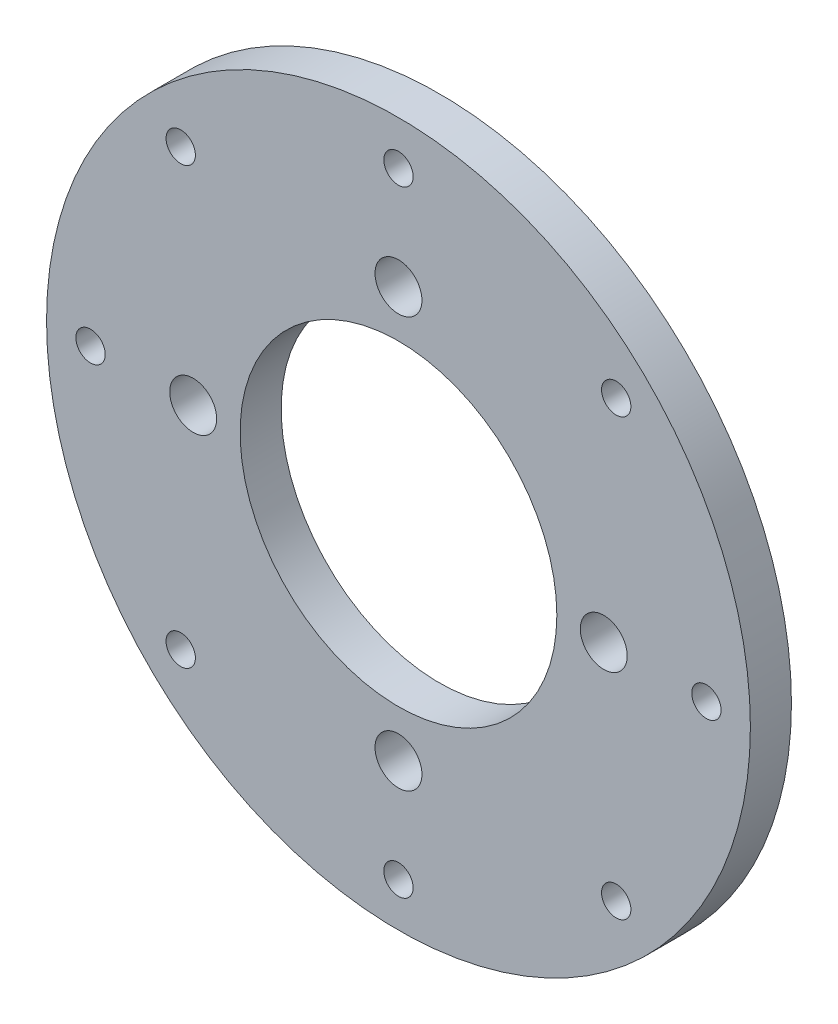
ISO-10303-21;
HEADER;
FILE_DESCRIPTION(('STEP AP214'),'2;1');
FILE_NAME('part.step','',(''),(''),'','','');
FILE_SCHEMA(('AUTOMOTIVE_DESIGN { 1 0 10303 214 1 1 1 1 }'));
ENDSEC;
DATA;
#1=APPLICATION_CONTEXT('core data for automotive mechanical design processes');
#2=APPLICATION_PROTOCOL_DEFINITION('international standard','automotive_design',2000,#1);
#3=PRODUCT_CONTEXT('',#1,'mechanical');
#4=PRODUCT('Part','Part','',(#3));
#5=PRODUCT_RELATED_PRODUCT_CATEGORY('part','',(#4));
#6=PRODUCT_DEFINITION_FORMATION('','',#4);
#7=PRODUCT_DEFINITION_CONTEXT('part definition',#1,'design');
#8=PRODUCT_DEFINITION('design','',#6,#7);
#9=PRODUCT_DEFINITION_SHAPE('','',#8);
#10=(LENGTH_UNIT() NAMED_UNIT(*) SI_UNIT(.MILLI.,.METRE.));
#11=(NAMED_UNIT(*) PLANE_ANGLE_UNIT() SI_UNIT($,.RADIAN.));
#12=(NAMED_UNIT(*) SI_UNIT($,.STERADIAN.) SOLID_ANGLE_UNIT());
#13=UNCERTAINTY_MEASURE_WITH_UNIT(LENGTH_MEASURE(1.E-05),#10,'distance_accuracy_value','');
#14=(GEOMETRIC_REPRESENTATION_CONTEXT(3) GLOBAL_UNCERTAINTY_ASSIGNED_CONTEXT((#13)) GLOBAL_UNIT_ASSIGNED_CONTEXT((#10,
#11,#12)) REPRESENTATION_CONTEXT('',''));
#15=CARTESIAN_POINT('',(0.,0.,0.));
#16=DIRECTION('',(0.,0.,1.));
#17=DIRECTION('',(1.,0.,0.));
#18=AXIS2_PLACEMENT_3D('',#15,#16,#17);
#19=CARTESIAN_POINT('',(0.,0.,7.));
#20=DIRECTION('',(0.,0.,-1.));
#21=DIRECTION('',(-1.,0.,0.));
#22=AXIS2_PLACEMENT_3D('',#19,#20,#21);
#23=CYLINDRICAL_SURFACE('',#22,60.);
#24=CARTESIAN_POINT('',(0.,0.,7.));
#25=DIRECTION('',(0.,0.,1.));
#26=DIRECTION('',(1.,0.,0.));
#27=AXIS2_PLACEMENT_3D('',#24,#25,#26);
#28=CIRCLE('',#27,60.);
#29=CARTESIAN_POINT('',(60.,0.,7.));
#30=VERTEX_POINT('',#29);
#31=EDGE_CURVE('E10',#30,#30,#28,.T.);
#32=ORIENTED_EDGE('',*,*,#31,.F.);
#33=EDGE_LOOP('',(#32));
#34=FACE_BOUND('',#33,.T.);
#35=CARTESIAN_POINT('',(0.,0.,0.));
#36=DIRECTION('',(0.,0.,1.));
#37=DIRECTION('',(1.,0.,0.));
#38=AXIS2_PLACEMENT_3D('',#35,#36,#37);
#39=CIRCLE('',#38,60.);
#40=CARTESIAN_POINT('',(60.,0.,0.));
#41=VERTEX_POINT('',#40);
#42=EDGE_CURVE('E36',#41,#41,#39,.T.);
#43=ORIENTED_EDGE('',*,*,#42,.T.);
#44=EDGE_LOOP('',(#43));
#45=FACE_BOUND('',#44,.T.);
#46=ADVANCED_FACE('F33',(#34,#45),#23,.T.);
#47=CARTESIAN_POINT('',(0.,0.,7.));
#48=DIRECTION('',(0.,0.,1.));
#49=DIRECTION('',(1.,0.,0.));
#50=AXIS2_PLACEMENT_3D('',#47,#48,#49);
#51=PLANE('',#50);
#52=CARTESIAN_POINT('',(52.5000000000015,1.48571034940069E-12,7.));
#53=DIRECTION('',(0.,0.,1.));
#54=DIRECTION('',(1.,0.,0.));
#55=AXIS2_PLACEMENT_3D('',#52,#53,#54);
#56=CIRCLE('',#55,2.50000000000117);
#57=CARTESIAN_POINT('',(55.0000000000026,1.48571034940069E-12,7.));
#58=VERTEX_POINT('',#57);
#59=EDGE_CURVE('E78',#58,#58,#56,.T.);
#60=ORIENTED_EDGE('',*,*,#59,.F.);
#61=EDGE_LOOP('',(#60));
#62=FACE_BOUND('',#61,.T.);
#63=CARTESIAN_POINT('',(37.1231060123011,-37.1231060122908,7.));
#64=DIRECTION('',(0.,0.,1.));
#65=DIRECTION('',(1.,0.,0.));
#66=AXIS2_PLACEMENT_3D('',#63,#64,#65);
#67=CIRCLE('',#66,2.50000000000633);
#68=CARTESIAN_POINT('',(39.6231060123074,-37.1231060122908,7.));
#69=VERTEX_POINT('',#68);
#70=EDGE_CURVE('E97',#69,#69,#67,.T.);
#71=ORIENTED_EDGE('',*,*,#70,.F.);
#72=EDGE_LOOP('',(#71));
#73=FACE_BOUND('',#72,.T.);
#74=CARTESIAN_POINT('',(-52.4999999999985,-1.49213974509621E-12,7.));
#75=DIRECTION('',(0.,0.,1.));
#76=DIRECTION('',(1.,0.,0.));
#77=AXIS2_PLACEMENT_3D('',#74,#75,#76);
#78=CIRCLE('',#77,2.50000000000239);
#79=CARTESIAN_POINT('',(-49.9999999999961,-1.49213974509621E-12,7.));
#80=VERTEX_POINT('',#79);
#81=EDGE_CURVE('E91',#80,#80,#78,.T.);
#82=ORIENTED_EDGE('',*,*,#81,.F.);
#83=EDGE_LOOP('',(#82));
#84=FACE_BOUND('',#83,.T.);
#85=CARTESIAN_POINT('',(-37.1231060122925,37.1231060122907,7.));
#86=DIRECTION('',(0.,0.,1.));
#87=DIRECTION('',(1.,0.,0.));
#88=AXIS2_PLACEMENT_3D('',#85,#86,#87);
#89=CIRCLE('',#88,2.50000000000272);
#90=CARTESIAN_POINT('',(-34.6231060122898,37.1231060122907,7.));
#91=VERTEX_POINT('',#90);
#92=EDGE_CURVE('E84',#91,#91,#89,.T.);
#93=ORIENTED_EDGE('',*,*,#92,.F.);
#94=EDGE_LOOP('',(#93));
#95=FACE_BOUND('',#94,.T.);
#96=CARTESIAN_POINT('',(0.,52.5,7.));
#97=DIRECTION('',(0.,0.,1.));
#98=DIRECTION('',(1.,0.,0.));
#99=AXIS2_PLACEMENT_3D('',#96,#97,#98);
#100=CIRCLE('',#99,2.5);
#101=CARTESIAN_POINT('',(2.5,52.5,7.));
#102=VERTEX_POINT('',#101);
#103=EDGE_CURVE('E85',#102,#102,#100,.T.);
#104=ORIENTED_EDGE('',*,*,#103,.F.);
#105=EDGE_LOOP('',(#104));
#106=FACE_BOUND('',#105,.T.);
#107=CARTESIAN_POINT('',(2.97142069880137E-12,-52.5,7.));
#108=DIRECTION('',(0.,0.,1.));
#109=DIRECTION('',(1.,0.,0.));
#110=AXIS2_PLACEMENT_3D('',#107,#108,#109);
#111=CIRCLE('',#110,2.50000000000319);
#112=CARTESIAN_POINT('',(2.50000000000617,-52.5,7.));
#113=VERTEX_POINT('',#112);
#114=EDGE_CURVE('E114',#113,#113,#111,.T.);
#115=ORIENTED_EDGE('',*,*,#114,.F.);
#116=EDGE_LOOP('',(#115));
#117=FACE_BOUND('',#116,.T.);
#118=CARTESIAN_POINT('',(-37.1231060122864,-37.1231060122968,7.));
#119=DIRECTION('',(0.,0.,1.));
#120=DIRECTION('',(1.,0.,0.));
#121=AXIS2_PLACEMENT_3D('',#118,#119,#120);
#122=CIRCLE('',#121,2.50000000000833);
#123=CARTESIAN_POINT('',(-34.6231060122781,-37.1231060122968,7.));
#124=VERTEX_POINT('',#123);
#125=EDGE_CURVE('E108',#124,#124,#122,.T.);
#126=ORIENTED_EDGE('',*,*,#125,.F.);
#127=EDGE_LOOP('',(#126));
#128=FACE_BOUND('',#127,.T.);
#129=CARTESIAN_POINT('',(37.123106012295,37.1231060122968,7.));
#130=DIRECTION('',(0.,0.,1.));
#131=DIRECTION('',(1.,0.,0.));
#132=AXIS2_PLACEMENT_3D('',#129,#130,#131);
#133=CIRCLE('',#132,2.50000000000038);
#134=CARTESIAN_POINT('',(39.6231060122954,37.1231060122968,7.));
#135=VERTEX_POINT('',#134);
#136=EDGE_CURVE('E75',#135,#135,#133,.T.);
#137=ORIENTED_EDGE('',*,*,#136,.F.);
#138=EDGE_LOOP('',(#137));
#139=FACE_BOUND('',#138,.T.);
#140=CARTESIAN_POINT('',(0.,35.,7.));
#141=DIRECTION('',(0.,0.,1.));
#142=DIRECTION('',(1.,0.,0.));
#143=AXIS2_PLACEMENT_3D('',#140,#141,#142);
#144=CIRCLE('',#143,4.);
#145=CARTESIAN_POINT('',(4.,35.,7.));
#146=VERTEX_POINT('',#145);
#147=EDGE_CURVE('E70',#146,#146,#144,.T.);
#148=ORIENTED_EDGE('',*,*,#147,.F.);
#149=EDGE_LOOP('',(#148));
#150=FACE_BOUND('',#149,.T.);
#151=CARTESIAN_POINT('',(35.0000000000047,0.,7.));
#152=DIRECTION('',(0.,0.,1.));
#153=DIRECTION('',(1.,0.,0.));
#154=AXIS2_PLACEMENT_3D('',#151,#152,#153);
#155=CIRCLE('',#154,4.);
#156=CARTESIAN_POINT('',(39.0000000000047,0.,7.));
#157=VERTEX_POINT('',#156);
#158=EDGE_CURVE('E64',#157,#157,#155,.T.);
#159=ORIENTED_EDGE('',*,*,#158,.F.);
#160=EDGE_LOOP('',(#159));
#161=FACE_BOUND('',#160,.T.);
#162=CARTESIAN_POINT('',(4.66722296722298E-12,-35.0000000000047,7.));
#163=DIRECTION('',(0.,0.,1.));
#164=DIRECTION('',(1.,0.,0.));
#165=AXIS2_PLACEMENT_3D('',#162,#163,#164);
#166=CIRCLE('',#165,4.);
#167=CARTESIAN_POINT('',(4.00000000000467,-35.0000000000047,7.));
#168=VERTEX_POINT('',#167);
#169=EDGE_CURVE('E58',#168,#168,#166,.T.);
#170=ORIENTED_EDGE('',*,*,#169,.F.);
#171=EDGE_LOOP('',(#170));
#172=FACE_BOUND('',#171,.T.);
#173=CARTESIAN_POINT('',(-35.,-4.65599780952237E-12,7.));
#174=DIRECTION('',(0.,0.,1.));
#175=DIRECTION('',(1.,0.,0.));
#176=AXIS2_PLACEMENT_3D('',#173,#174,#175);
#177=CIRCLE('',#176,4.);
#178=CARTESIAN_POINT('',(-31.,-4.65599780952237E-12,7.));
#179=VERTEX_POINT('',#178);
#180=EDGE_CURVE('E51',#179,#179,#177,.T.);
#181=ORIENTED_EDGE('',*,*,#180,.F.);
#182=EDGE_LOOP('',(#181));
#183=FACE_BOUND('',#182,.T.);
#184=CARTESIAN_POINT('',(0.,0.,7.));
#185=DIRECTION('',(0.,0.,1.));
#186=DIRECTION('',(1.,0.,0.));
#187=AXIS2_PLACEMENT_3D('',#184,#185,#186);
#188=CIRCLE('',#187,27.);
#189=CARTESIAN_POINT('',(27.,0.,7.));
#190=VERTEX_POINT('',#189);
#191=EDGE_CURVE('E45',#190,#190,#188,.T.);
#192=ORIENTED_EDGE('',*,*,#191,.F.);
#193=EDGE_LOOP('',(#192));
#194=FACE_BOUND('',#193,.T.);
#195=ORIENTED_EDGE('',*,*,#31,.T.);
#196=EDGE_LOOP('',(#195));
#197=FACE_BOUND('',#196,.T.);
#198=ADVANCED_FACE('F125',(#62,#73,#84,#95,#106,#117,#128,#139,#150,#161,#172,#183,#194,#197),
#51,.T.);
#199=CARTESIAN_POINT('',(0.,0.,0.));
#200=DIRECTION('',(0.,0.,1.));
#201=DIRECTION('',(1.,0.,0.));
#202=AXIS2_PLACEMENT_3D('',#199,#200,#201);
#203=PLANE('',#202);
#204=CARTESIAN_POINT('',(52.5000000000015,1.48571034940069E-12,0.));
#205=DIRECTION('',(0.,0.,1.));
#206=DIRECTION('',(1.,0.,0.));
#207=AXIS2_PLACEMENT_3D('',#204,#205,#206);
#208=CIRCLE('',#207,2.50000000000117);
#209=CARTESIAN_POINT('',(55.0000000000026,1.48571034940069E-12,0.));
#210=VERTEX_POINT('',#209);
#211=EDGE_CURVE('E100',#210,#210,#208,.T.);
#212=ORIENTED_EDGE('',*,*,#211,.T.);
#213=EDGE_LOOP('',(#212));
#214=FACE_BOUND('',#213,.T.);
#215=CARTESIAN_POINT('',(37.1231060123011,-37.1231060122908,0.));
#216=DIRECTION('',(0.,0.,1.));
#217=DIRECTION('',(1.,0.,0.));
#218=AXIS2_PLACEMENT_3D('',#215,#216,#217);
#219=CIRCLE('',#218,2.50000000000633);
#220=CARTESIAN_POINT('',(39.6231060123074,-37.1231060122908,0.));
#221=VERTEX_POINT('',#220);
#222=EDGE_CURVE('E94',#221,#221,#219,.T.);
#223=ORIENTED_EDGE('',*,*,#222,.T.);
#224=EDGE_LOOP('',(#223));
#225=FACE_BOUND('',#224,.T.);
#226=CARTESIAN_POINT('',(-52.4999999999985,-1.49213974509621E-12,0.));
#227=DIRECTION('',(0.,0.,1.));
#228=DIRECTION('',(1.,0.,0.));
#229=AXIS2_PLACEMENT_3D('',#226,#227,#228);
#230=CIRCLE('',#229,2.50000000000239);
#231=CARTESIAN_POINT('',(-49.9999999999961,-1.49213974509621E-12,0.));
#232=VERTEX_POINT('',#231);
#233=EDGE_CURVE('E88',#232,#232,#230,.T.);
#234=ORIENTED_EDGE('',*,*,#233,.T.);
#235=EDGE_LOOP('',(#234));
#236=FACE_BOUND('',#235,.T.);
#237=CARTESIAN_POINT('',(-37.1231060122925,37.1231060122907,0.));
#238=DIRECTION('',(0.,0.,1.));
#239=DIRECTION('',(1.,0.,0.));
#240=AXIS2_PLACEMENT_3D('',#237,#238,#239);
#241=CIRCLE('',#240,2.50000000000272);
#242=CARTESIAN_POINT('',(-34.6231060122898,37.1231060122907,0.));
#243=VERTEX_POINT('',#242);
#244=EDGE_CURVE('E81',#243,#243,#241,.T.);
#245=ORIENTED_EDGE('',*,*,#244,.T.);
#246=EDGE_LOOP('',(#245));
#247=FACE_BOUND('',#246,.T.);
#248=CARTESIAN_POINT('',(0.,52.5,0.));
#249=DIRECTION('',(0.,0.,1.));
#250=DIRECTION('',(1.,0.,0.));
#251=AXIS2_PLACEMENT_3D('',#248,#249,#250);
#252=CIRCLE('',#251,2.5);
#253=CARTESIAN_POINT('',(2.5,52.5,0.));
#254=VERTEX_POINT('',#253);
#255=EDGE_CURVE('E117',#254,#254,#252,.T.);
#256=ORIENTED_EDGE('',*,*,#255,.T.);
#257=EDGE_LOOP('',(#256));
#258=FACE_BOUND('',#257,.T.);
#259=CARTESIAN_POINT('',(2.97142069880137E-12,-52.5,0.));
#260=DIRECTION('',(0.,0.,1.));
#261=DIRECTION('',(1.,0.,0.));
#262=AXIS2_PLACEMENT_3D('',#259,#260,#261);
#263=CIRCLE('',#262,2.50000000000319);
#264=CARTESIAN_POINT('',(2.50000000000617,-52.5,0.));
#265=VERTEX_POINT('',#264);
#266=EDGE_CURVE('E111',#265,#265,#263,.T.);
#267=ORIENTED_EDGE('',*,*,#266,.T.);
#268=EDGE_LOOP('',(#267));
#269=FACE_BOUND('',#268,.T.);
#270=CARTESIAN_POINT('',(-37.1231060122864,-37.1231060122968,0.));
#271=DIRECTION('',(0.,0.,1.));
#272=DIRECTION('',(1.,0.,0.));
#273=AXIS2_PLACEMENT_3D('',#270,#271,#272);
#274=CIRCLE('',#273,2.50000000000833);
#275=CARTESIAN_POINT('',(-34.6231060122781,-37.1231060122968,0.));
#276=VERTEX_POINT('',#275);
#277=EDGE_CURVE('E105',#276,#276,#274,.T.);
#278=ORIENTED_EDGE('',*,*,#277,.T.);
#279=EDGE_LOOP('',(#278));
#280=FACE_BOUND('',#279,.T.);
#281=CARTESIAN_POINT('',(37.123106012295,37.1231060122968,0.));
#282=DIRECTION('',(0.,0.,1.));
#283=DIRECTION('',(1.,0.,0.));
#284=AXIS2_PLACEMENT_3D('',#281,#282,#283);
#285=CIRCLE('',#284,2.50000000000038);
#286=CARTESIAN_POINT('',(39.6231060122954,37.1231060122968,0.));
#287=VERTEX_POINT('',#286);
#288=EDGE_CURVE('E55',#287,#287,#285,.T.);
#289=ORIENTED_EDGE('',*,*,#288,.T.);
#290=EDGE_LOOP('',(#289));
#291=FACE_BOUND('',#290,.T.);
#292=CARTESIAN_POINT('',(0.,35.,0.));
#293=DIRECTION('',(0.,0.,1.));
#294=DIRECTION('',(1.,0.,0.));
#295=AXIS2_PLACEMENT_3D('',#292,#293,#294);
#296=CIRCLE('',#295,4.);
#297=CARTESIAN_POINT('',(4.,35.,0.));
#298=VERTEX_POINT('',#297);
#299=EDGE_CURVE('E48',#298,#298,#296,.T.);
#300=ORIENTED_EDGE('',*,*,#299,.T.);
#301=EDGE_LOOP('',(#300));
#302=FACE_BOUND('',#301,.T.);
#303=CARTESIAN_POINT('',(35.0000000000047,0.,0.));
#304=DIRECTION('',(0.,0.,1.));
#305=DIRECTION('',(1.,0.,0.));
#306=AXIS2_PLACEMENT_3D('',#303,#304,#305);
#307=CIRCLE('',#306,4.);
#308=CARTESIAN_POINT('',(39.0000000000047,0.,0.));
#309=VERTEX_POINT('',#308);
#310=EDGE_CURVE('E67',#309,#309,#307,.T.);
#311=ORIENTED_EDGE('',*,*,#310,.T.);
#312=EDGE_LOOP('',(#311));
#313=FACE_BOUND('',#312,.T.);
#314=CARTESIAN_POINT('',(4.66722296722298E-12,-35.0000000000047,0.));
#315=DIRECTION('',(0.,0.,1.));
#316=DIRECTION('',(1.,0.,0.));
#317=AXIS2_PLACEMENT_3D('',#314,#315,#316);
#318=CIRCLE('',#317,4.);
#319=CARTESIAN_POINT('',(4.00000000000467,-35.0000000000047,0.));
#320=VERTEX_POINT('',#319);
#321=EDGE_CURVE('E61',#320,#320,#318,.T.);
#322=ORIENTED_EDGE('',*,*,#321,.T.);
#323=EDGE_LOOP('',(#322));
#324=FACE_BOUND('',#323,.T.);
#325=CARTESIAN_POINT('',(-35.,-4.65599780952237E-12,0.));
#326=DIRECTION('',(0.,0.,1.));
#327=DIRECTION('',(1.,0.,0.));
#328=AXIS2_PLACEMENT_3D('',#325,#326,#327);
#329=CIRCLE('',#328,4.);
#330=CARTESIAN_POINT('',(-31.,-4.65599780952237E-12,0.));
#331=VERTEX_POINT('',#330);
#332=EDGE_CURVE('E54',#331,#331,#329,.T.);
#333=ORIENTED_EDGE('',*,*,#332,.T.);
#334=EDGE_LOOP('',(#333));
#335=FACE_BOUND('',#334,.T.);
#336=CARTESIAN_POINT('',(0.,0.,0.));
#337=DIRECTION('',(0.,0.,1.));
#338=DIRECTION('',(1.,0.,0.));
#339=AXIS2_PLACEMENT_3D('',#336,#337,#338);
#340=CIRCLE('',#339,27.);
#341=CARTESIAN_POINT('',(27.,0.,0.));
#342=VERTEX_POINT('',#341);
#343=EDGE_CURVE('E43',#342,#342,#340,.T.);
#344=ORIENTED_EDGE('',*,*,#343,.T.);
#345=EDGE_LOOP('',(#344));
#346=FACE_BOUND('',#345,.T.);
#347=ORIENTED_EDGE('',*,*,#42,.F.);
#348=EDGE_LOOP('',(#347));
#349=FACE_BOUND('',#348,.T.);
#350=ADVANCED_FACE('F128',(#214,#225,#236,#247,#258,#269,#280,#291,#302,#313,#324,#335,#346,
#349),#203,.F.);
#351=CARTESIAN_POINT('',(0.,0.,0.));
#352=DIRECTION('',(0.,0.,1.));
#353=DIRECTION('',(1.,0.,0.));
#354=AXIS2_PLACEMENT_3D('',#351,#352,#353);
#355=CYLINDRICAL_SURFACE('',#354,27.);
#356=ORIENTED_EDGE('',*,*,#343,.F.);
#357=EDGE_LOOP('',(#356));
#358=FACE_BOUND('',#357,.T.);
#359=ORIENTED_EDGE('',*,*,#191,.T.);
#360=EDGE_LOOP('',(#359));
#361=FACE_BOUND('',#360,.T.);
#362=ADVANCED_FACE('F147',(#358,#361),#355,.F.);
#363=CARTESIAN_POINT('',(-35.,-4.65599780952237E-12,0.));
#364=DIRECTION('',(0.,0.,1.));
#365=DIRECTION('',(1.,0.,0.));
#366=AXIS2_PLACEMENT_3D('',#363,#364,#365);
#367=CYLINDRICAL_SURFACE('',#366,4.);
#368=ORIENTED_EDGE('',*,*,#332,.F.);
#369=EDGE_LOOP('',(#368));
#370=FACE_BOUND('',#369,.T.);
#371=ORIENTED_EDGE('',*,*,#180,.T.);
#372=EDGE_LOOP('',(#371));
#373=FACE_BOUND('',#372,.T.);
#374=ADVANCED_FACE('F149',(#370,#373),#367,.F.);
#375=CARTESIAN_POINT('',(4.66722296722298E-12,-35.0000000000047,0.));
#376=DIRECTION('',(0.,0.,1.));
#377=DIRECTION('',(1.,0.,0.));
#378=AXIS2_PLACEMENT_3D('',#375,#376,#377);
#379=CYLINDRICAL_SURFACE('',#378,4.);
#380=ORIENTED_EDGE('',*,*,#321,.F.);
#381=EDGE_LOOP('',(#380));
#382=FACE_BOUND('',#381,.T.);
#383=ORIENTED_EDGE('',*,*,#169,.T.);
#384=EDGE_LOOP('',(#383));
#385=FACE_BOUND('',#384,.T.);
#386=ADVANCED_FACE('F156',(#382,#385),#379,.F.);
#387=CARTESIAN_POINT('',(35.0000000000047,0.,0.));
#388=DIRECTION('',(0.,0.,1.));
#389=DIRECTION('',(1.,0.,0.));
#390=AXIS2_PLACEMENT_3D('',#387,#388,#389);
#391=CYLINDRICAL_SURFACE('',#390,4.);
#392=ORIENTED_EDGE('',*,*,#310,.F.);
#393=EDGE_LOOP('',(#392));
#394=FACE_BOUND('',#393,.T.);
#395=ORIENTED_EDGE('',*,*,#158,.T.);
#396=EDGE_LOOP('',(#395));
#397=FACE_BOUND('',#396,.T.);
#398=ADVANCED_FACE('F272',(#394,#397),#391,.F.);
#399=CARTESIAN_POINT('',(0.,35.,0.));
#400=DIRECTION('',(0.,0.,1.));
#401=DIRECTION('',(1.,0.,0.));
#402=AXIS2_PLACEMENT_3D('',#399,#400,#401);
#403=CYLINDRICAL_SURFACE('',#402,4.);
#404=ORIENTED_EDGE('',*,*,#299,.F.);
#405=EDGE_LOOP('',(#404));
#406=FACE_BOUND('',#405,.T.);
#407=ORIENTED_EDGE('',*,*,#147,.T.);
#408=EDGE_LOOP('',(#407));
#409=FACE_BOUND('',#408,.T.);
#410=ADVANCED_FACE('F189',(#406,#409),#403,.F.);
#411=CARTESIAN_POINT('',(37.123106012295,37.1231060122968,0.));
#412=DIRECTION('',(0.,0.,1.));
#413=DIRECTION('',(1.,0.,0.));
#414=AXIS2_PLACEMENT_3D('',#411,#412,#413);
#415=CYLINDRICAL_SURFACE('',#414,2.50000000000038);
#416=ORIENTED_EDGE('',*,*,#288,.F.);
#417=EDGE_LOOP('',(#416));
#418=FACE_BOUND('',#417,.T.);
#419=ORIENTED_EDGE('',*,*,#136,.T.);
#420=EDGE_LOOP('',(#419));
#421=FACE_BOUND('',#420,.T.);
#422=ADVANCED_FACE('F183',(#418,#421),#415,.F.);
#423=CARTESIAN_POINT('',(-37.1231060122864,-37.1231060122968,0.));
#424=DIRECTION('',(0.,0.,1.));
#425=DIRECTION('',(1.,0.,0.));
#426=AXIS2_PLACEMENT_3D('',#423,#424,#425);
#427=CYLINDRICAL_SURFACE('',#426,2.50000000000833);
#428=ORIENTED_EDGE('',*,*,#277,.F.);
#429=EDGE_LOOP('',(#428));
#430=FACE_BOUND('',#429,.T.);
#431=ORIENTED_EDGE('',*,*,#125,.T.);
#432=EDGE_LOOP('',(#431));
#433=FACE_BOUND('',#432,.T.);
#434=ADVANCED_FACE('F188',(#430,#433),#427,.F.);
#435=CARTESIAN_POINT('',(2.97142069880137E-12,-52.5,0.));
#436=DIRECTION('',(0.,0.,1.));
#437=DIRECTION('',(1.,0.,0.));
#438=AXIS2_PLACEMENT_3D('',#435,#436,#437);
#439=CYLINDRICAL_SURFACE('',#438,2.50000000000319);
#440=ORIENTED_EDGE('',*,*,#266,.F.);
#441=EDGE_LOOP('',(#440));
#442=FACE_BOUND('',#441,.T.);
#443=ORIENTED_EDGE('',*,*,#114,.T.);
#444=EDGE_LOOP('',(#443));
#445=FACE_BOUND('',#444,.T.);
#446=ADVANCED_FACE('F201',(#442,#445),#439,.F.);
#447=CARTESIAN_POINT('',(0.,52.5,0.));
#448=DIRECTION('',(0.,0.,1.));
#449=DIRECTION('',(1.,0.,0.));
#450=AXIS2_PLACEMENT_3D('',#447,#448,#449);
#451=CYLINDRICAL_SURFACE('',#450,2.5);
#452=ORIENTED_EDGE('',*,*,#255,.F.);
#453=EDGE_LOOP('',(#452));
#454=FACE_BOUND('',#453,.T.);
#455=ORIENTED_EDGE('',*,*,#103,.T.);
#456=EDGE_LOOP('',(#455));
#457=FACE_BOUND('',#456,.T.);
#458=ADVANCED_FACE('F123',(#454,#457),#451,.F.);
#459=CARTESIAN_POINT('',(-37.1231060122925,37.1231060122907,0.));
#460=DIRECTION('',(0.,0.,1.));
#461=DIRECTION('',(1.,0.,0.));
#462=AXIS2_PLACEMENT_3D('',#459,#460,#461);
#463=CYLINDRICAL_SURFACE('',#462,2.50000000000272);
#464=ORIENTED_EDGE('',*,*,#244,.F.);
#465=EDGE_LOOP('',(#464));
#466=FACE_BOUND('',#465,.T.);
#467=ORIENTED_EDGE('',*,*,#92,.T.);
#468=EDGE_LOOP('',(#467));
#469=FACE_BOUND('',#468,.T.);
#470=ADVANCED_FACE('F220',(#466,#469),#463,.F.);
#471=CARTESIAN_POINT('',(-52.4999999999985,-1.49213974509621E-12,0.));
#472=DIRECTION('',(0.,0.,1.));
#473=DIRECTION('',(1.,0.,0.));
#474=AXIS2_PLACEMENT_3D('',#471,#472,#473);
#475=CYLINDRICAL_SURFACE('',#474,2.50000000000239);
#476=ORIENTED_EDGE('',*,*,#233,.F.);
#477=EDGE_LOOP('',(#476));
#478=FACE_BOUND('',#477,.T.);
#479=ORIENTED_EDGE('',*,*,#81,.T.);
#480=EDGE_LOOP('',(#479));
#481=FACE_BOUND('',#480,.T.);
#482=ADVANCED_FACE('F230',(#478,#481),#475,.F.);
#483=CARTESIAN_POINT('',(37.1231060123011,-37.1231060122908,0.));
#484=DIRECTION('',(0.,0.,1.));
#485=DIRECTION('',(1.,0.,0.));
#486=AXIS2_PLACEMENT_3D('',#483,#484,#485);
#487=CYLINDRICAL_SURFACE('',#486,2.50000000000633);
#488=ORIENTED_EDGE('',*,*,#222,.F.);
#489=EDGE_LOOP('',(#488));
#490=FACE_BOUND('',#489,.T.);
#491=ORIENTED_EDGE('',*,*,#70,.T.);
#492=EDGE_LOOP('',(#491));
#493=FACE_BOUND('',#492,.T.);
#494=ADVANCED_FACE('F241',(#490,#493),#487,.F.);
#495=CARTESIAN_POINT('',(52.5000000000015,1.48571034940069E-12,0.));
#496=DIRECTION('',(0.,0.,1.));
#497=DIRECTION('',(1.,0.,0.));
#498=AXIS2_PLACEMENT_3D('',#495,#496,#497);
#499=CYLINDRICAL_SURFACE('',#498,2.50000000000117);
#500=ORIENTED_EDGE('',*,*,#211,.F.);
#501=EDGE_LOOP('',(#500));
#502=FACE_BOUND('',#501,.T.);
#503=ORIENTED_EDGE('',*,*,#59,.T.);
#504=EDGE_LOOP('',(#503));
#505=FACE_BOUND('',#504,.T.);
#506=ADVANCED_FACE('F251',(#502,#505),#499,.F.);
#507=CLOSED_SHELL('',(#46,#198,#350,#362,#374,#386,#398,#410,#422,#434,#446,#458,#470,#482,#494,#506));
#508=MANIFOLD_SOLID_BREP('B2',#507);
#509=ADVANCED_BREP_SHAPE_REPRESENTATION('',(#18,#508),#14);
#510=SHAPE_DEFINITION_REPRESENTATION(#9,#509);
ENDSEC;
END-ISO-10303-21;
